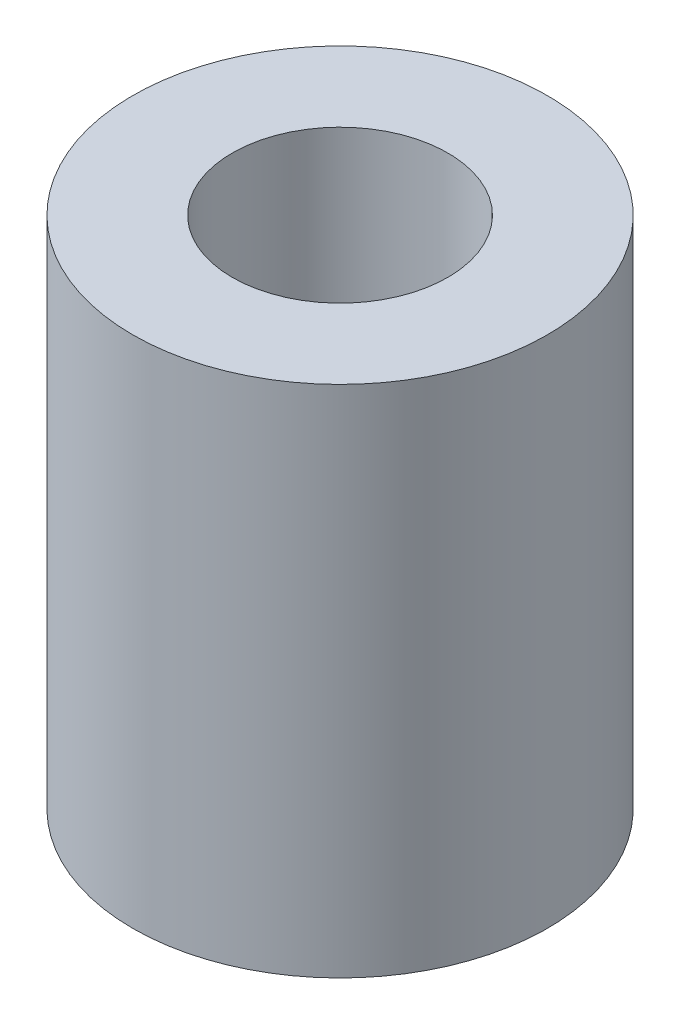
ISO-10303-21;
HEADER;
FILE_DESCRIPTION(('STEP AP214'),'2;1');
FILE_NAME('part.step','',(''),(''),'','','');
FILE_SCHEMA(('AUTOMOTIVE_DESIGN { 1 0 10303 214 1 1 1 1 }'));
ENDSEC;
DATA;
#1=APPLICATION_CONTEXT('core data for automotive mechanical design processes');
#2=APPLICATION_PROTOCOL_DEFINITION('international standard','automotive_design',2000,#1);
#3=PRODUCT_CONTEXT('',#1,'mechanical');
#4=PRODUCT('Part','Part','',(#3));
#5=PRODUCT_RELATED_PRODUCT_CATEGORY('part','',(#4));
#6=PRODUCT_DEFINITION_FORMATION('','',#4);
#7=PRODUCT_DEFINITION_CONTEXT('part definition',#1,'design');
#8=PRODUCT_DEFINITION('design','',#6,#7);
#9=PRODUCT_DEFINITION_SHAPE('','',#8);
#10=(LENGTH_UNIT() NAMED_UNIT(*) SI_UNIT(.MILLI.,.METRE.));
#11=(NAMED_UNIT(*) PLANE_ANGLE_UNIT() SI_UNIT($,.RADIAN.));
#12=(NAMED_UNIT(*) SI_UNIT($,.STERADIAN.) SOLID_ANGLE_UNIT());
#13=UNCERTAINTY_MEASURE_WITH_UNIT(LENGTH_MEASURE(1.E-05),#10,'distance_accuracy_value','');
#14=(GEOMETRIC_REPRESENTATION_CONTEXT(3) GLOBAL_UNCERTAINTY_ASSIGNED_CONTEXT((#13)) GLOBAL_UNIT_ASSIGNED_CONTEXT((#10,
#11,#12)) REPRESENTATION_CONTEXT('',''));
#15=CARTESIAN_POINT('',(0.,0.,0.));
#16=DIRECTION('',(0.,0.,1.));
#17=DIRECTION('',(1.,0.,0.));
#18=AXIS2_PLACEMENT_3D('',#15,#16,#17);
#19=CARTESIAN_POINT('',(0.,31.,0.));
#20=DIRECTION('',(0.,1.,0.));
#21=DIRECTION('',(0.,0.,1.));
#22=AXIS2_PLACEMENT_3D('',#19,#20,#21);
#23=PLANE('',#22);
#24=CARTESIAN_POINT('',(0.,31.,0.));
#25=DIRECTION('',(0.,1.,0.));
#26=DIRECTION('',(0.,0.,1.));
#27=AXIS2_PLACEMENT_3D('',#24,#25,#26);
#28=CIRCLE('',#27,12.5);
#29=CARTESIAN_POINT('',(0.,31.,12.5));
#30=VERTEX_POINT('',#29);
#31=EDGE_CURVE('E10',#30,#30,#28,.T.);
#32=ORIENTED_EDGE('',*,*,#31,.T.);
#33=EDGE_LOOP('',(#32));
#34=FACE_BOUND('',#33,.T.);
#35=CARTESIAN_POINT('',(0.,31.,0.));
#36=DIRECTION('',(0.,1.,0.));
#37=DIRECTION('',(0.,0.,1.));
#38=AXIS2_PLACEMENT_3D('',#35,#36,#37);
#39=CIRCLE('',#38,6.5);
#40=CARTESIAN_POINT('',(0.,31.,6.5));
#41=VERTEX_POINT('',#40);
#42=EDGE_CURVE('E39',#41,#41,#39,.T.);
#43=ORIENTED_EDGE('',*,*,#42,.F.);
#44=EDGE_LOOP('',(#43));
#45=FACE_BOUND('',#44,.T.);
#46=ADVANCED_FACE('F28',(#34,#45),#23,.T.);
#47=CARTESIAN_POINT('',(0.,0.,0.));
#48=DIRECTION('',(0.,1.,0.));
#49=DIRECTION('',(0.,0.,1.));
#50=AXIS2_PLACEMENT_3D('',#47,#48,#49);
#51=PLANE('',#50);
#52=CARTESIAN_POINT('',(0.,0.,0.));
#53=DIRECTION('',(0.,1.,0.));
#54=DIRECTION('',(0.,0.,1.));
#55=AXIS2_PLACEMENT_3D('',#52,#53,#54);
#56=CIRCLE('',#55,12.5);
#57=CARTESIAN_POINT('',(0.,0.,12.5));
#58=VERTEX_POINT('',#57);
#59=EDGE_CURVE('E32',#58,#58,#56,.T.);
#60=ORIENTED_EDGE('',*,*,#59,.F.);
#61=EDGE_LOOP('',(#60));
#62=FACE_BOUND('',#61,.T.);
#63=CARTESIAN_POINT('',(0.,0.,0.));
#64=DIRECTION('',(0.,1.,0.));
#65=DIRECTION('',(0.,0.,1.));
#66=AXIS2_PLACEMENT_3D('',#63,#64,#65);
#67=CIRCLE('',#66,6.5);
#68=CARTESIAN_POINT('',(0.,0.,6.5));
#69=VERTEX_POINT('',#68);
#70=EDGE_CURVE('E41',#69,#69,#67,.T.);
#71=ORIENTED_EDGE('',*,*,#70,.T.);
#72=EDGE_LOOP('',(#71));
#73=FACE_BOUND('',#72,.T.);
#74=ADVANCED_FACE('F51',(#62,#73),#51,.F.);
#75=CARTESIAN_POINT('',(0.,31.,0.));
#76=DIRECTION('',(0.,-1.,0.));
#77=DIRECTION('',(0.,0.,-1.));
#78=AXIS2_PLACEMENT_3D('',#75,#76,#77);
#79=CYLINDRICAL_SURFACE('',#78,12.5);
#80=ORIENTED_EDGE('',*,*,#31,.F.);
#81=EDGE_LOOP('',(#80));
#82=FACE_BOUND('',#81,.T.);
#83=ORIENTED_EDGE('',*,*,#59,.T.);
#84=EDGE_LOOP('',(#83));
#85=FACE_BOUND('',#84,.T.);
#86=ADVANCED_FACE('F30',(#82,#85),#79,.T.);
#87=CARTESIAN_POINT('',(0.,31.,0.));
#88=DIRECTION('',(0.,-1.,0.));
#89=DIRECTION('',(0.,0.,-1.));
#90=AXIS2_PLACEMENT_3D('',#87,#88,#89);
#91=CYLINDRICAL_SURFACE('',#90,6.5);
#92=ORIENTED_EDGE('',*,*,#42,.T.);
#93=EDGE_LOOP('',(#92));
#94=FACE_BOUND('',#93,.T.);
#95=ORIENTED_EDGE('',*,*,#70,.F.);
#96=EDGE_LOOP('',(#95));
#97=FACE_BOUND('',#96,.T.);
#98=ADVANCED_FACE('F47',(#94,#97),#91,.F.);
#99=CLOSED_SHELL('',(#46,#74,#86,#98));
#100=MANIFOLD_SOLID_BREP('B2',#99);
#101=ADVANCED_BREP_SHAPE_REPRESENTATION('',(#18,#100),#14);
#102=SHAPE_DEFINITION_REPRESENTATION(#9,#101);
ENDSEC;
END-ISO-10303-21;
